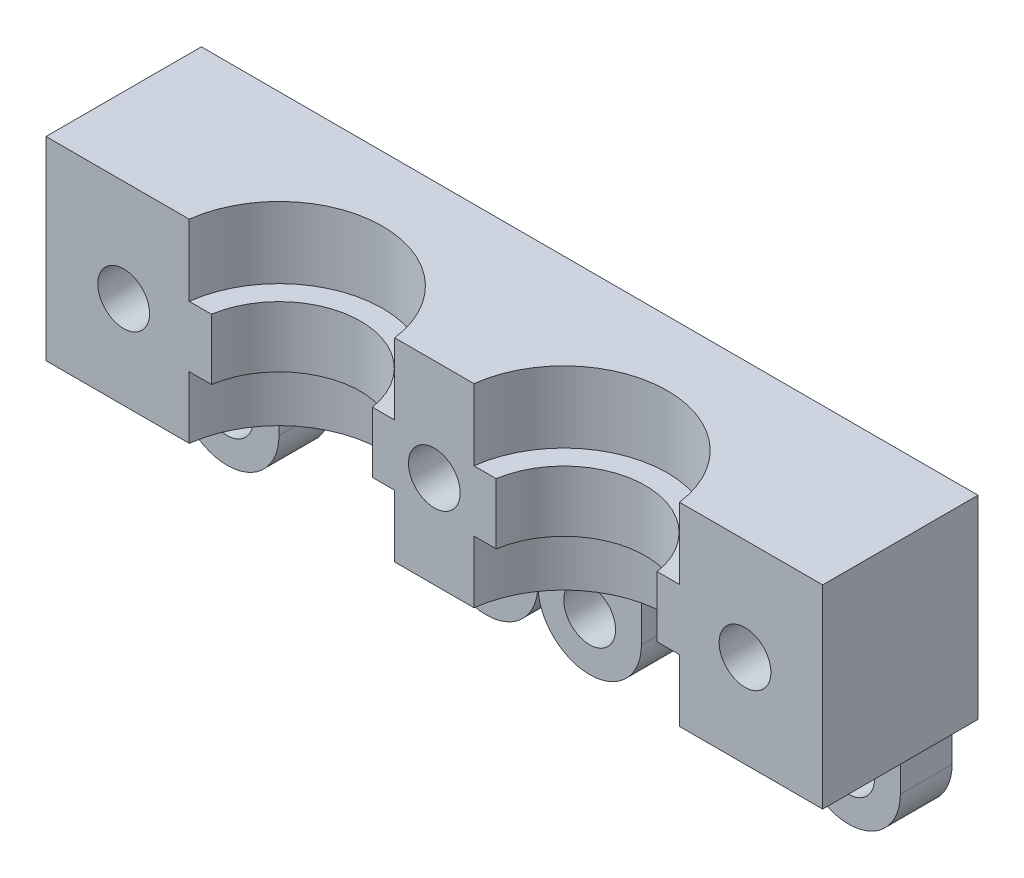
ISO-10303-21;
HEADER;
FILE_DESCRIPTION(('STEP AP214'),'2;1');
FILE_NAME('part.step','',(''),(''),'','','');
FILE_SCHEMA(('AUTOMOTIVE_DESIGN { 1 0 10303 214 1 1 1 1 }'));
ENDSEC;
DATA;
#1=APPLICATION_CONTEXT('core data for automotive mechanical design processes');
#2=APPLICATION_PROTOCOL_DEFINITION('international standard','automotive_design',2000,#1);
#3=PRODUCT_CONTEXT('',#1,'mechanical');
#4=PRODUCT('Part','Part','',(#3));
#5=PRODUCT_RELATED_PRODUCT_CATEGORY('part','',(#4));
#6=PRODUCT_DEFINITION_FORMATION('','',#4);
#7=PRODUCT_DEFINITION_CONTEXT('part definition',#1,'design');
#8=PRODUCT_DEFINITION('design','',#6,#7);
#9=PRODUCT_DEFINITION_SHAPE('','',#8);
#10=(LENGTH_UNIT() NAMED_UNIT(*) SI_UNIT(.MILLI.,.METRE.));
#11=(NAMED_UNIT(*) PLANE_ANGLE_UNIT() SI_UNIT($,.RADIAN.));
#12=(NAMED_UNIT(*) SI_UNIT($,.STERADIAN.) SOLID_ANGLE_UNIT());
#13=UNCERTAINTY_MEASURE_WITH_UNIT(LENGTH_MEASURE(1.E-05),#10,'distance_accuracy_value','');
#14=(GEOMETRIC_REPRESENTATION_CONTEXT(3) GLOBAL_UNCERTAINTY_ASSIGNED_CONTEXT((#13)) GLOBAL_UNIT_ASSIGNED_CONTEXT((#10,
#11,#12)) REPRESENTATION_CONTEXT('',''));
#15=CARTESIAN_POINT('',(0.,0.,0.));
#16=DIRECTION('',(0.,0.,1.));
#17=DIRECTION('',(1.,0.,0.));
#18=AXIS2_PLACEMENT_3D('',#15,#16,#17);
#19=CARTESIAN_POINT('',(-30.,-8.,15.));
#20=DIRECTION('',(0.,1.,0.));
#21=DIRECTION('',(-1.,0.,0.));
#22=AXIS2_PLACEMENT_3D('',#19,#20,#21);
#23=PLANE('',#22);
#24=DIRECTION('',(0.,0.,-1.));
#25=VECTOR('',#24,1.);
#26=CARTESIAN_POINT('',(30.,-8.,15.));
#27=LINE('',#26,#25);
#28=CARTESIAN_POINT('',(30.,-8.,12.));
#29=VERTEX_POINT('',#28);
#30=CARTESIAN_POINT('',(30.,-8.00000000000001,0.));
#31=VERTEX_POINT('',#30);
#32=EDGE_CURVE('E256',#29,#31,#27,.T.);
#33=ORIENTED_EDGE('',*,*,#32,.F.);
#34=DIRECTION('',(1.,0.,0.));
#35=VECTOR('',#34,1.);
#36=CARTESIAN_POINT('',(30.,-8.,12.));
#37=LINE('',#36,#35);
#38=CARTESIAN_POINT('',(18.9372539331938,-8.,12.));
#39=VERTEX_POINT('',#38);
#40=EDGE_CURVE('E234',#39,#29,#37,.T.);
#41=ORIENTED_EDGE('',*,*,#40,.F.);
#42=CARTESIAN_POINT('',(11.,-8.,13.));
#43=DIRECTION('',(0.,-1.,0.));
#44=DIRECTION('',(0.,0.,1.));
#45=AXIS2_PLACEMENT_3D('',#42,#43,#44);
#46=CIRCLE('',#45,8.);
#47=CARTESIAN_POINT('',(3.06274606680622,-8.,12.));
#48=VERTEX_POINT('',#47);
#49=EDGE_CURVE('E408',#48,#39,#46,.T.);
#50=ORIENTED_EDGE('',*,*,#49,.F.);
#51=CARTESIAN_POINT('',(-3.06274606680623,-8.,12.));
#52=VERTEX_POINT('',#51);
#53=EDGE_CURVE('E483',#52,#48,#37,.T.);
#54=ORIENTED_EDGE('',*,*,#53,.F.);
#55=CARTESIAN_POINT('',(-11.,-8.,13.));
#56=DIRECTION('',(0.,-1.,0.));
#57=DIRECTION('',(0.,0.,-1.));
#58=AXIS2_PLACEMENT_3D('',#55,#56,#57);
#59=CIRCLE('',#58,8.);
#60=CARTESIAN_POINT('',(-18.9372539331938,-8.,12.));
#61=VERTEX_POINT('',#60);
#62=EDGE_CURVE('E410',#61,#52,#59,.T.);
#63=ORIENTED_EDGE('',*,*,#62,.F.);
#64=CARTESIAN_POINT('',(-30.,-8.,12.));
#65=VERTEX_POINT('',#64);
#66=EDGE_CURVE('E485',#65,#61,#37,.T.);
#67=ORIENTED_EDGE('',*,*,#66,.F.);
#68=DIRECTION('',(0.,0.,-1.));
#69=VECTOR('',#68,1.);
#70=CARTESIAN_POINT('',(-30.,-8.,15.));
#71=LINE('',#70,#69);
#72=CARTESIAN_POINT('',(-30.,-8.00000000000001,0.));
#73=VERTEX_POINT('',#72);
#74=EDGE_CURVE('E257',#65,#73,#71,.T.);
#75=ORIENTED_EDGE('',*,*,#74,.T.);
#76=DIRECTION('',(1.,0.,0.));
#77=VECTOR('',#76,1.);
#78=CARTESIAN_POINT('',(-30.,-8.00000000000001,0.));
#79=LINE('',#78,#77);
#80=CARTESIAN_POINT('',(-28.,-8.,0.));
#81=VERTEX_POINT('',#80);
#82=EDGE_CURVE('E380',#73,#81,#79,.T.);
#83=ORIENTED_EDGE('',*,*,#82,.T.);
#84=DIRECTION('',(0.,0.,-1.));
#85=VECTOR('',#84,1.);
#86=CARTESIAN_POINT('',(-28.,-8.,15.));
#87=LINE('',#86,#85);
#88=CARTESIAN_POINT('',(-28.,-8.,4.));
#89=VERTEX_POINT('',#88);
#90=EDGE_CURVE('E277',#89,#81,#87,.T.);
#91=ORIENTED_EDGE('',*,*,#90,.F.);
#92=DIRECTION('',(1.,0.,0.));
#93=VECTOR('',#92,1.);
#94=CARTESIAN_POINT('',(-30.,-8.,4.));
#95=LINE('',#94,#93);
#96=CARTESIAN_POINT('',(28.,-8.,4.));
#97=VERTEX_POINT('',#96);
#98=EDGE_CURVE('E45',#89,#97,#95,.T.);
#99=ORIENTED_EDGE('',*,*,#98,.T.);
#100=DIRECTION('',(0.,0.,1.));
#101=VECTOR('',#100,1.);
#102=CARTESIAN_POINT('',(28.,-8.,15.));
#103=LINE('',#102,#101);
#104=CARTESIAN_POINT('',(28.,-8.,0.));
#105=VERTEX_POINT('',#104);
#106=EDGE_CURVE('E11',#105,#97,#103,.T.);
#107=ORIENTED_EDGE('',*,*,#106,.F.);
#108=EDGE_CURVE('E379',#105,#31,#79,.T.);
#109=ORIENTED_EDGE('',*,*,#108,.T.);
#110=EDGE_LOOP('',(#33,#41,#50,#54,#63,#67,#75,#83,#91,#99,#107,#109));
#111=FACE_BOUND('',#110,.T.);
#112=ADVANCED_FACE('F35',(#111),#23,.F.);
#113=CARTESIAN_POINT('',(-11.,7.,13.));
#114=DIRECTION('',(0.,-1.,0.));
#115=DIRECTION('',(0.,0.,-1.));
#116=AXIS2_PLACEMENT_3D('',#113,#114,#115);
#117=CYLINDRICAL_SURFACE('',#116,8.);
#118=ORIENTED_EDGE('',*,*,#62,.T.);
#119=DIRECTION('',(0.,-1.,0.));
#120=VECTOR('',#119,1.);
#121=CARTESIAN_POINT('',(-3.06274606680622,7.,12.));
#122=LINE('',#121,#120);
#123=CARTESIAN_POINT('',(-3.06274606680622,-3.2,12.));
#124=VERTEX_POINT('',#123);
#125=EDGE_CURVE('E527',#52,#124,#122,.F.);
#126=ORIENTED_EDGE('',*,*,#125,.T.);
#127=CARTESIAN_POINT('',(-11.,-3.2,13.));
#128=DIRECTION('',(0.,-1.,0.));
#129=DIRECTION('',(0.,0.,-1.));
#130=AXIS2_PLACEMENT_3D('',#127,#128,#129);
#131=CIRCLE('',#130,8.);
#132=CARTESIAN_POINT('',(-18.9372539331938,-3.2,12.));
#133=VERTEX_POINT('',#132);
#134=EDGE_CURVE('E405',#124,#133,#131,.F.);
#135=ORIENTED_EDGE('',*,*,#134,.T.);
#136=DIRECTION('',(0.,-1.,0.));
#137=VECTOR('',#136,1.);
#138=CARTESIAN_POINT('',(-18.9372539331938,7.,12.));
#139=LINE('',#138,#137);
#140=EDGE_CURVE('E518',#133,#61,#139,.T.);
#141=ORIENTED_EDGE('',*,*,#140,.T.);
#142=EDGE_LOOP('',(#118,#126,#135,#141));
#143=FACE_BOUND('',#142,.T.);
#144=ADVANCED_FACE('F570',(#143),#117,.F.);
#145=CARTESIAN_POINT('',(11.,7.,13.));
#146=DIRECTION('',(0.,-1.,0.));
#147=DIRECTION('',(0.,0.,-1.));
#148=AXIS2_PLACEMENT_3D('',#145,#146,#147);
#149=CYLINDRICAL_SURFACE('',#148,8.);
#150=ORIENTED_EDGE('',*,*,#49,.T.);
#151=DIRECTION('',(0.,-1.,0.));
#152=VECTOR('',#151,1.);
#153=CARTESIAN_POINT('',(18.9372539331938,7.,12.));
#154=LINE('',#153,#152);
#155=CARTESIAN_POINT('',(18.9372539331938,-3.2,12.));
#156=VERTEX_POINT('',#155);
#157=EDGE_CURVE('E490',#39,#156,#154,.F.);
#158=ORIENTED_EDGE('',*,*,#157,.T.);
#159=CARTESIAN_POINT('',(11.,-3.2,13.));
#160=DIRECTION('',(0.,-1.,0.));
#161=DIRECTION('',(0.,0.,-1.));
#162=AXIS2_PLACEMENT_3D('',#159,#160,#161);
#163=CIRCLE('',#162,8.);
#164=CARTESIAN_POINT('',(3.06274606680622,-3.2,12.));
#165=VERTEX_POINT('',#164);
#166=EDGE_CURVE('E270',#156,#165,#163,.F.);
#167=ORIENTED_EDGE('',*,*,#166,.T.);
#168=DIRECTION('',(0.,-1.,0.));
#169=VECTOR('',#168,1.);
#170=CARTESIAN_POINT('',(3.06274606680622,7.,12.));
#171=LINE('',#170,#169);
#172=EDGE_CURVE('E492',#165,#48,#171,.T.);
#173=ORIENTED_EDGE('',*,*,#172,.T.);
#174=EDGE_LOOP('',(#150,#158,#167,#173));
#175=FACE_BOUND('',#174,.T.);
#176=ADVANCED_FACE('F489',(#175),#149,.F.);
#177=CARTESIAN_POINT('',(30.,15.,5.));
#178=DIRECTION('',(-1.,0.,0.));
#179=DIRECTION('',(0.,-1.,0.));
#180=AXIS2_PLACEMENT_3D('',#177,#178,#179);
#181=PLANE('',#180);
#182=DIRECTION('',(0.,0.,-1.));
#183=VECTOR('',#182,1.);
#184=CARTESIAN_POINT('',(30.,7.,15.));
#185=LINE('',#184,#183);
#186=CARTESIAN_POINT('',(30.,7.,12.));
#187=VERTEX_POINT('',#186);
#188=CARTESIAN_POINT('',(30.,7.,0.));
#189=VERTEX_POINT('',#188);
#190=EDGE_CURVE('E245',#187,#189,#185,.T.);
#191=ORIENTED_EDGE('',*,*,#190,.F.);
#192=DIRECTION('',(0.,1.,0.));
#193=VECTOR('',#192,1.);
#194=CARTESIAN_POINT('',(30.,7.,12.));
#195=LINE('',#194,#193);
#196=EDGE_CURVE('E228',#29,#187,#195,.T.);
#197=ORIENTED_EDGE('',*,*,#196,.F.);
#198=ORIENTED_EDGE('',*,*,#32,.T.);
#199=DIRECTION('',(0.,1.,0.));
#200=VECTOR('',#199,1.);
#201=CARTESIAN_POINT('',(30.,15.,0.));
#202=LINE('',#201,#200);
#203=EDGE_CURVE('E254',#31,#189,#202,.T.);
#204=ORIENTED_EDGE('',*,*,#203,.T.);
#205=EDGE_LOOP('',(#191,#197,#198,#204));
#206=FACE_BOUND('',#205,.T.);
#207=ADVANCED_FACE('F37',(#206),#181,.F.);
#208=CARTESIAN_POINT('',(-30.,15.,5.));
#209=DIRECTION('',(1.,0.,0.));
#210=DIRECTION('',(0.,1.,0.));
#211=AXIS2_PLACEMENT_3D('',#208,#209,#210);
#212=PLANE('',#211);
#213=ORIENTED_EDGE('',*,*,#74,.F.);
#214=DIRECTION('',(0.,-1.,0.));
#215=VECTOR('',#214,1.);
#216=CARTESIAN_POINT('',(-30.,7.,12.));
#217=LINE('',#216,#215);
#218=CARTESIAN_POINT('',(-30.,7.,12.));
#219=VERTEX_POINT('',#218);
#220=EDGE_CURVE('E250',#219,#65,#217,.T.);
#221=ORIENTED_EDGE('',*,*,#220,.F.);
#222=DIRECTION('',(0.,0.,-1.));
#223=VECTOR('',#222,1.);
#224=CARTESIAN_POINT('',(-30.,7.,15.));
#225=LINE('',#224,#223);
#226=CARTESIAN_POINT('',(-30.,7.,0.));
#227=VERTEX_POINT('',#226);
#228=EDGE_CURVE('E39',#219,#227,#225,.T.);
#229=ORIENTED_EDGE('',*,*,#228,.T.);
#230=DIRECTION('',(0.,-1.,0.));
#231=VECTOR('',#230,1.);
#232=CARTESIAN_POINT('',(-30.,15.,0.));
#233=LINE('',#232,#231);
#234=EDGE_CURVE('E271',#227,#73,#233,.T.);
#235=ORIENTED_EDGE('',*,*,#234,.T.);
#236=EDGE_LOOP('',(#213,#221,#229,#235));
#237=FACE_BOUND('',#236,.T.);
#238=ADVANCED_FACE('F422',(#237),#212,.F.);
#239=CARTESIAN_POINT('',(0.,0.,0.));
#240=DIRECTION('',(0.,0.,1.));
#241=DIRECTION('',(1.,0.,0.));
#242=AXIS2_PLACEMENT_3D('',#239,#240,#241);
#243=PLANE('',#242);
#244=ORIENTED_EDGE('',*,*,#108,.F.);
#245=DIRECTION('',(0.,1.,0.));
#246=VECTOR('',#245,1.);
#247=CARTESIAN_POINT('',(28.,-12.0064356958142,0.));
#248=LINE('',#247,#246);
#249=CARTESIAN_POINT('',(28.,-12.0064356958142,0.));
#250=VERTEX_POINT('',#249);
#251=EDGE_CURVE('E293',#250,#105,#248,.T.);
#252=ORIENTED_EDGE('',*,*,#251,.F.);
#253=CARTESIAN_POINT('',(24.,-12.0064356958142,0.));
#254=DIRECTION('',(0.,0.,1.));
#255=DIRECTION('',(1.,0.,0.));
#256=AXIS2_PLACEMENT_3D('',#253,#254,#255);
#257=CIRCLE('',#256,4.);
#258=CARTESIAN_POINT('',(20.,-12.0064356958142,0.));
#259=VERTEX_POINT('',#258);
#260=EDGE_CURVE('E324',#259,#250,#257,.T.);
#261=ORIENTED_EDGE('',*,*,#260,.F.);
#262=DIRECTION('',(0.,-1.,0.));
#263=VECTOR('',#262,1.);
#264=CARTESIAN_POINT('',(20.,-12.0064356958142,0.));
#265=LINE('',#264,#263);
#266=CARTESIAN_POINT('',(20.,-8.00643569581419,0.));
#267=VERTEX_POINT('',#266);
#268=EDGE_CURVE('E302',#267,#259,#265,.T.);
#269=ORIENTED_EDGE('',*,*,#268,.F.);
#270=DIRECTION('',(1.,0.,0.));
#271=VECTOR('',#270,1.);
#272=CARTESIAN_POINT('',(8.,-8.00643569581419,0.));
#273=LINE('',#272,#271);
#274=CARTESIAN_POINT('',(8.,-8.00643569581419,0.));
#275=VERTEX_POINT('',#274);
#276=EDGE_CURVE('E345',#275,#267,#273,.T.);
#277=ORIENTED_EDGE('',*,*,#276,.F.);
#278=DIRECTION('',(0.,1.,0.));
#279=VECTOR('',#278,1.);
#280=CARTESIAN_POINT('',(8.,-12.0064356958142,0.));
#281=LINE('',#280,#279);
#282=CARTESIAN_POINT('',(8.,-12.0064356958142,0.));
#283=VERTEX_POINT('',#282);
#284=EDGE_CURVE('E343',#283,#275,#281,.T.);
#285=ORIENTED_EDGE('',*,*,#284,.F.);
#286=CARTESIAN_POINT('',(4.,-12.0064356958142,0.));
#287=DIRECTION('',(0.,0.,1.));
#288=DIRECTION('',(-1.,0.,0.));
#289=AXIS2_PLACEMENT_3D('',#286,#287,#288);
#290=CIRCLE('',#289,4.);
#291=CARTESIAN_POINT('',(0.,-12.0064356958142,0.));
#292=VERTEX_POINT('',#291);
#293=EDGE_CURVE('E341',#292,#283,#290,.T.);
#294=ORIENTED_EDGE('',*,*,#293,.F.);
#295=CARTESIAN_POINT('',(-4.,-12.0064356958142,0.));
#296=DIRECTION('',(0.,0.,1.));
#297=DIRECTION('',(-1.,0.,0.));
#298=AXIS2_PLACEMENT_3D('',#295,#296,#297);
#299=CIRCLE('',#298,4.);
#300=CARTESIAN_POINT('',(-8.,-12.0064356958142,0.));
#301=VERTEX_POINT('',#300);
#302=EDGE_CURVE('E339',#301,#292,#299,.T.);
#303=ORIENTED_EDGE('',*,*,#302,.F.);
#304=DIRECTION('',(0.,-1.,0.));
#305=VECTOR('',#304,1.);
#306=CARTESIAN_POINT('',(-8.,-12.0064356958142,0.));
#307=LINE('',#306,#305);
#308=CARTESIAN_POINT('',(-8.,-8.00643569581419,0.));
#309=VERTEX_POINT('',#308);
#310=EDGE_CURVE('E337',#309,#301,#307,.T.);
#311=ORIENTED_EDGE('',*,*,#310,.F.);
#312=DIRECTION('',(1.,0.,0.));
#313=VECTOR('',#312,1.);
#314=CARTESIAN_POINT('',(-20.,-8.00643569581419,0.));
#315=LINE('',#314,#313);
#316=CARTESIAN_POINT('',(-20.,-8.00643569581419,0.));
#317=VERTEX_POINT('',#316);
#318=EDGE_CURVE('E335',#317,#309,#315,.T.);
#319=ORIENTED_EDGE('',*,*,#318,.F.);
#320=DIRECTION('',(0.,1.,0.));
#321=VECTOR('',#320,1.);
#322=CARTESIAN_POINT('',(-20.,-12.0064356958142,0.));
#323=LINE('',#322,#321);
#324=CARTESIAN_POINT('',(-20.,-12.0064356958142,0.));
#325=VERTEX_POINT('',#324);
#326=EDGE_CURVE('E333',#325,#317,#323,.T.);
#327=ORIENTED_EDGE('',*,*,#326,.F.);
#328=CARTESIAN_POINT('',(-24.,-12.0064356958142,0.));
#329=DIRECTION('',(0.,0.,1.));
#330=DIRECTION('',(-1.,0.,0.));
#331=AXIS2_PLACEMENT_3D('',#328,#329,#330);
#332=CIRCLE('',#331,3.99999999999999);
#333=CARTESIAN_POINT('',(-28.,-12.0064356958142,0.));
#334=VERTEX_POINT('',#333);
#335=EDGE_CURVE('E331',#334,#325,#332,.T.);
#336=ORIENTED_EDGE('',*,*,#335,.F.);
#337=DIRECTION('',(0.,-1.,0.));
#338=VECTOR('',#337,1.);
#339=CARTESIAN_POINT('',(-28.,-12.0064356958142,0.));
#340=LINE('',#339,#338);
#341=EDGE_CURVE('E329',#81,#334,#340,.T.);
#342=ORIENTED_EDGE('',*,*,#341,.F.);
#343=ORIENTED_EDGE('',*,*,#82,.F.);
#344=ORIENTED_EDGE('',*,*,#234,.F.);
#345=DIRECTION('',(-1.,0.,0.));
#346=VECTOR('',#345,1.);
#347=CARTESIAN_POINT('',(30.,7.,0.));
#348=LINE('',#347,#346);
#349=EDGE_CURVE('E382',#189,#227,#348,.T.);
#350=ORIENTED_EDGE('',*,*,#349,.F.);
#351=ORIENTED_EDGE('',*,*,#203,.F.);
#352=EDGE_LOOP('',(#244,#252,#261,#269,#277,#285,#294,#303,#311,#319,#327,#336,#342,#343,#344,
#350,#351));
#353=FACE_BOUND('',#352,.T.);
#354=CARTESIAN_POINT('',(-4.,-12.0064356958142,0.));
#355=DIRECTION('',(0.,0.,1.));
#356=DIRECTION('',(-1.,0.,0.));
#357=AXIS2_PLACEMENT_3D('',#354,#355,#356);
#358=CIRCLE('',#357,2.);
#359=CARTESIAN_POINT('',(-6.,-12.0064356958142,0.));
#360=VERTEX_POINT('',#359);
#361=EDGE_CURVE('E530',#360,#360,#358,.T.);
#362=ORIENTED_EDGE('',*,*,#361,.T.);
#363=EDGE_LOOP('',(#362));
#364=FACE_BOUND('',#363,.T.);
#365=CARTESIAN_POINT('',(-24.,-12.0064356958142,0.));
#366=DIRECTION('',(0.,0.,1.));
#367=DIRECTION('',(-1.,0.,0.));
#368=AXIS2_PLACEMENT_3D('',#365,#366,#367);
#369=CIRCLE('',#368,2.);
#370=CARTESIAN_POINT('',(-26.,-12.0064356958142,0.));
#371=VERTEX_POINT('',#370);
#372=EDGE_CURVE('E540',#371,#371,#369,.T.);
#373=ORIENTED_EDGE('',*,*,#372,.T.);
#374=EDGE_LOOP('',(#373));
#375=FACE_BOUND('',#374,.T.);
#376=CARTESIAN_POINT('',(24.,-12.0064356958142,0.));
#377=DIRECTION('',(0.,0.,1.));
#378=DIRECTION('',(1.,0.,0.));
#379=AXIS2_PLACEMENT_3D('',#376,#377,#378);
#380=CIRCLE('',#379,2.);
#381=CARTESIAN_POINT('',(26.,-12.0064356958142,0.));
#382=VERTEX_POINT('',#381);
#383=EDGE_CURVE('E546',#382,#382,#380,.T.);
#384=ORIENTED_EDGE('',*,*,#383,.T.);
#385=EDGE_LOOP('',(#384));
#386=FACE_BOUND('',#385,.T.);
#387=CARTESIAN_POINT('',(4.,-12.0064356958142,0.));
#388=DIRECTION('',(0.,0.,1.));
#389=DIRECTION('',(1.,0.,0.));
#390=AXIS2_PLACEMENT_3D('',#387,#388,#389);
#391=CIRCLE('',#390,2.);
#392=CARTESIAN_POINT('',(6.,-12.0064356958142,0.));
#393=VERTEX_POINT('',#392);
#394=EDGE_CURVE('E534',#393,#393,#391,.T.);
#395=ORIENTED_EDGE('',*,*,#394,.T.);
#396=EDGE_LOOP('',(#395));
#397=FACE_BOUND('',#396,.T.);
#398=CARTESIAN_POINT('',(0.,-0.850000000000002,0.));
#399=DIRECTION('',(0.,0.,1.));
#400=DIRECTION('',(1.,0.,0.));
#401=AXIS2_PLACEMENT_3D('',#398,#399,#400);
#402=CIRCLE('',#401,2.);
#403=CARTESIAN_POINT('',(2.,-0.850000000000002,0.));
#404=VERTEX_POINT('',#403);
#405=EDGE_CURVE('E390',#404,#404,#402,.T.);
#406=ORIENTED_EDGE('',*,*,#405,.T.);
#407=EDGE_LOOP('',(#406));
#408=FACE_BOUND('',#407,.T.);
#409=CARTESIAN_POINT('',(24.,-0.850000000000002,0.));
#410=DIRECTION('',(0.,0.,1.));
#411=DIRECTION('',(1.,0.,0.));
#412=AXIS2_PLACEMENT_3D('',#409,#410,#411);
#413=CIRCLE('',#412,2.);
#414=CARTESIAN_POINT('',(26.,-0.850000000000002,0.));
#415=VERTEX_POINT('',#414);
#416=EDGE_CURVE('E387',#415,#415,#413,.T.);
#417=ORIENTED_EDGE('',*,*,#416,.T.);
#418=EDGE_LOOP('',(#417));
#419=FACE_BOUND('',#418,.T.);
#420=CARTESIAN_POINT('',(-24.,-0.850000000000002,0.));
#421=DIRECTION('',(0.,0.,1.));
#422=DIRECTION('',(1.,0.,0.));
#423=AXIS2_PLACEMENT_3D('',#420,#421,#422);
#424=CIRCLE('',#423,2.);
#425=CARTESIAN_POINT('',(-22.,-0.850000000000002,0.));
#426=VERTEX_POINT('',#425);
#427=EDGE_CURVE('E384',#426,#426,#424,.T.);
#428=ORIENTED_EDGE('',*,*,#427,.T.);
#429=EDGE_LOOP('',(#428));
#430=FACE_BOUND('',#429,.T.);
#431=ADVANCED_FACE('F426',(#353,#364,#375,#386,#397,#408,#419,#430),#243,.F.);
#432=CARTESIAN_POINT('',(-30.,7.,15.));
#433=DIRECTION('',(0.,-1.,0.));
#434=DIRECTION('',(0.,0.,-1.));
#435=AXIS2_PLACEMENT_3D('',#432,#433,#434);
#436=PLANE('',#435);
#437=ORIENTED_EDGE('',*,*,#228,.F.);
#438=DIRECTION('',(-1.,0.,0.));
#439=VECTOR('',#438,1.);
#440=CARTESIAN_POINT('',(30.,7.,12.));
#441=LINE('',#440,#439);
#442=CARTESIAN_POINT('',(-18.9372539331938,7.,12.));
#443=VERTEX_POINT('',#442);
#444=EDGE_CURVE('E238',#443,#219,#441,.T.);
#445=ORIENTED_EDGE('',*,*,#444,.F.);
#446=CARTESIAN_POINT('',(-11.,7.,13.));
#447=DIRECTION('',(0.,-1.,0.));
#448=DIRECTION('',(0.,0.,-1.));
#449=AXIS2_PLACEMENT_3D('',#446,#447,#448);
#450=CIRCLE('',#449,8.);
#451=CARTESIAN_POINT('',(-3.06274606680623,7.,12.));
#452=VERTEX_POINT('',#451);
#453=EDGE_CURVE('E259',#443,#452,#450,.T.);
#454=ORIENTED_EDGE('',*,*,#453,.T.);
#455=CARTESIAN_POINT('',(3.06274606680622,7.,12.));
#456=VERTEX_POINT('',#455);
#457=EDGE_CURVE('E251',#456,#452,#441,.T.);
#458=ORIENTED_EDGE('',*,*,#457,.F.);
#459=CARTESIAN_POINT('',(11.,7.,13.));
#460=DIRECTION('',(0.,-1.,0.));
#461=DIRECTION('',(0.,0.,1.));
#462=AXIS2_PLACEMENT_3D('',#459,#460,#461);
#463=CIRCLE('',#462,8.);
#464=CARTESIAN_POINT('',(18.9372539331938,7.,12.));
#465=VERTEX_POINT('',#464);
#466=EDGE_CURVE('E249',#456,#465,#463,.T.);
#467=ORIENTED_EDGE('',*,*,#466,.T.);
#468=EDGE_CURVE('E231',#187,#465,#441,.T.);
#469=ORIENTED_EDGE('',*,*,#468,.F.);
#470=ORIENTED_EDGE('',*,*,#190,.T.);
#471=ORIENTED_EDGE('',*,*,#349,.T.);
#472=EDGE_LOOP('',(#437,#445,#454,#458,#467,#469,#470,#471));
#473=FACE_BOUND('',#472,.T.);
#474=ADVANCED_FACE('F243',(#473),#436,.F.);
#475=CARTESIAN_POINT('',(-11.,1.5,13.));
#476=DIRECTION('',(0.,1.,0.));
#477=DIRECTION('',(0.,0.,1.));
#478=AXIS2_PLACEMENT_3D('',#475,#476,#477);
#479=CIRCLE('',#478,8.);
#480=CARTESIAN_POINT('',(-18.9372539331938,1.5,12.));
#481=VERTEX_POINT('',#480);
#482=CARTESIAN_POINT('',(-3.06274606680622,1.5,12.));
#483=VERTEX_POINT('',#482);
#484=EDGE_CURVE('E402',#481,#483,#479,.F.);
#485=ORIENTED_EDGE('',*,*,#484,.T.);
#486=DIRECTION('',(0.,-1.,0.));
#487=VECTOR('',#486,1.);
#488=CARTESIAN_POINT('',(-3.06274606680622,7.,12.));
#489=LINE('',#488,#487);
#490=EDGE_CURVE('E524',#483,#452,#489,.F.);
#491=ORIENTED_EDGE('',*,*,#490,.T.);
#492=ORIENTED_EDGE('',*,*,#453,.F.);
#493=DIRECTION('',(0.,-1.,0.));
#494=VECTOR('',#493,1.);
#495=CARTESIAN_POINT('',(-18.9372539331938,7.,12.));
#496=LINE('',#495,#494);
#497=EDGE_CURVE('E514',#443,#481,#496,.T.);
#498=ORIENTED_EDGE('',*,*,#497,.T.);
#499=EDGE_LOOP('',(#485,#491,#492,#498));
#500=FACE_BOUND('',#499,.T.);
#501=ADVANCED_FACE('F579',(#500),#117,.F.);
#502=CARTESIAN_POINT('',(11.,1.5,13.));
#503=DIRECTION('',(0.,1.,0.));
#504=DIRECTION('',(0.,0.,1.));
#505=AXIS2_PLACEMENT_3D('',#502,#503,#504);
#506=CIRCLE('',#505,8.);
#507=CARTESIAN_POINT('',(3.06274606680622,1.5,12.));
#508=VERTEX_POINT('',#507);
#509=CARTESIAN_POINT('',(18.9372539331938,1.5,12.));
#510=VERTEX_POINT('',#509);
#511=EDGE_CURVE('E267',#508,#510,#506,.F.);
#512=ORIENTED_EDGE('',*,*,#511,.T.);
#513=DIRECTION('',(0.,-1.,0.));
#514=VECTOR('',#513,1.);
#515=CARTESIAN_POINT('',(18.9372539331938,7.,12.));
#516=LINE('',#515,#514);
#517=EDGE_CURVE('E504',#510,#465,#516,.F.);
#518=ORIENTED_EDGE('',*,*,#517,.T.);
#519=ORIENTED_EDGE('',*,*,#466,.F.);
#520=DIRECTION('',(0.,-1.,0.));
#521=VECTOR('',#520,1.);
#522=CARTESIAN_POINT('',(3.06274606680622,7.,12.));
#523=LINE('',#522,#521);
#524=EDGE_CURVE('E494',#456,#508,#523,.T.);
#525=ORIENTED_EDGE('',*,*,#524,.T.);
#526=EDGE_LOOP('',(#512,#518,#519,#525));
#527=FACE_BOUND('',#526,.T.);
#528=ADVANCED_FACE('F591',(#527),#149,.F.);
#529=CARTESIAN_POINT('',(-30.,1.5,-55.1838018074631));
#530=DIRECTION('',(0.,1.,0.));
#531=DIRECTION('',(0.,0.,1.));
#532=AXIS2_PLACEMENT_3D('',#529,#530,#531);
#533=PLANE('',#532);
#534=DIRECTION('',(-1.,0.,0.));
#535=VECTOR('',#534,1.);
#536=CARTESIAN_POINT('',(-30.,1.5,12.));
#537=LINE('',#536,#535);
#538=CARTESIAN_POINT('',(17.2201286160336,1.5,12.));
#539=VERTEX_POINT('',#538);
#540=EDGE_CURVE('E506',#510,#539,#537,.T.);
#541=ORIENTED_EDGE('',*,*,#540,.F.);
#542=ORIENTED_EDGE('',*,*,#511,.F.);
#543=CARTESIAN_POINT('',(4.7798713839664,1.5,12.));
#544=VERTEX_POINT('',#543);
#545=EDGE_CURVE('E500',#544,#508,#537,.T.);
#546=ORIENTED_EDGE('',*,*,#545,.F.);
#547=CARTESIAN_POINT('',(11.,1.5,13.));
#548=DIRECTION('',(0.,1.,0.));
#549=DIRECTION('',(0.,0.,1.));
#550=AXIS2_PLACEMENT_3D('',#547,#548,#549);
#551=CIRCLE('',#550,6.3);
#552=EDGE_CURVE('E396',#539,#544,#551,.T.);
#553=ORIENTED_EDGE('',*,*,#552,.F.);
#554=EDGE_LOOP('',(#541,#542,#546,#553));
#555=FACE_BOUND('',#554,.T.);
#556=ADVANCED_FACE('F596',(#555),#533,.T.);
#557=CARTESIAN_POINT('',(-30.,-3.2,-55.1838018074631));
#558=DIRECTION('',(0.,-1.,0.));
#559=DIRECTION('',(0.,0.,-1.));
#560=AXIS2_PLACEMENT_3D('',#557,#558,#559);
#561=PLANE('',#560);
#562=DIRECTION('',(1.,0.,0.));
#563=VECTOR('',#562,1.);
#564=CARTESIAN_POINT('',(-30.,-3.2,12.));
#565=LINE('',#564,#563);
#566=CARTESIAN_POINT('',(4.7798713839664,-3.2,12.));
#567=VERTEX_POINT('',#566);
#568=EDGE_CURVE('E61',#165,#567,#565,.T.);
#569=ORIENTED_EDGE('',*,*,#568,.F.);
#570=ORIENTED_EDGE('',*,*,#166,.F.);
#571=CARTESIAN_POINT('',(17.2201286160336,-3.2,12.));
#572=VERTEX_POINT('',#571);
#573=EDGE_CURVE('E497',#572,#156,#565,.T.);
#574=ORIENTED_EDGE('',*,*,#573,.F.);
#575=CARTESIAN_POINT('',(11.,-3.2,13.));
#576=DIRECTION('',(0.,-1.,0.));
#577=DIRECTION('',(0.,0.,1.));
#578=AXIS2_PLACEMENT_3D('',#575,#576,#577);
#579=CIRCLE('',#578,6.3);
#580=EDGE_CURVE('E393',#567,#572,#579,.T.);
#581=ORIENTED_EDGE('',*,*,#580,.F.);
#582=EDGE_LOOP('',(#569,#570,#574,#581));
#583=FACE_BOUND('',#582,.T.);
#584=ADVANCED_FACE('F602',(#583),#561,.T.);
#585=DIRECTION('',(1.,0.,0.));
#586=VECTOR('',#585,1.);
#587=CARTESIAN_POINT('',(-30.,-3.2,12.));
#588=LINE('',#587,#586);
#589=CARTESIAN_POINT('',(-17.2201286160336,-3.2,12.));
#590=VERTEX_POINT('',#589);
#591=EDGE_CURVE('E53',#133,#590,#588,.T.);
#592=ORIENTED_EDGE('',*,*,#591,.F.);
#593=ORIENTED_EDGE('',*,*,#134,.F.);
#594=CARTESIAN_POINT('',(-4.7798713839664,-3.2,12.));
#595=VERTEX_POINT('',#594);
#596=EDGE_CURVE('E515',#595,#124,#588,.T.);
#597=ORIENTED_EDGE('',*,*,#596,.F.);
#598=CARTESIAN_POINT('',(-11.,-3.2,13.));
#599=DIRECTION('',(0.,-1.,0.));
#600=DIRECTION('',(0.,0.,-1.));
#601=AXIS2_PLACEMENT_3D('',#598,#599,#600);
#602=CIRCLE('',#601,6.3);
#603=EDGE_CURVE('E399',#590,#595,#602,.T.);
#604=ORIENTED_EDGE('',*,*,#603,.F.);
#605=EDGE_LOOP('',(#592,#593,#597,#604));
#606=FACE_BOUND('',#605,.T.);
#607=ADVANCED_FACE('F627',(#606),#561,.T.);
#608=DIRECTION('',(-1.,0.,0.));
#609=VECTOR('',#608,1.);
#610=CARTESIAN_POINT('',(-30.,1.5,12.));
#611=LINE('',#610,#609);
#612=CARTESIAN_POINT('',(-4.7798713839664,1.5,12.));
#613=VERTEX_POINT('',#612);
#614=EDGE_CURVE('E512',#483,#613,#611,.T.);
#615=ORIENTED_EDGE('',*,*,#614,.F.);
#616=ORIENTED_EDGE('',*,*,#484,.F.);
#617=CARTESIAN_POINT('',(-17.2201286160336,1.5,12.));
#618=VERTEX_POINT('',#617);
#619=EDGE_CURVE('E510',#618,#481,#611,.T.);
#620=ORIENTED_EDGE('',*,*,#619,.F.);
#621=CARTESIAN_POINT('',(-11.,1.5,13.));
#622=DIRECTION('',(0.,1.,0.));
#623=DIRECTION('',(0.,0.,1.));
#624=AXIS2_PLACEMENT_3D('',#621,#622,#623);
#625=CIRCLE('',#624,6.3);
#626=EDGE_CURVE('E274',#613,#618,#625,.T.);
#627=ORIENTED_EDGE('',*,*,#626,.F.);
#628=EDGE_LOOP('',(#615,#616,#620,#627));
#629=FACE_BOUND('',#628,.T.);
#630=ADVANCED_FACE('F605',(#629),#533,.T.);
#631=CARTESIAN_POINT('',(-11.,1.8,13.));
#632=DIRECTION('',(0.,-1.,0.));
#633=DIRECTION('',(0.,0.,-1.));
#634=AXIS2_PLACEMENT_3D('',#631,#632,#633);
#635=CYLINDRICAL_SURFACE('',#634,6.3);
#636=ORIENTED_EDGE('',*,*,#603,.T.);
#637=DIRECTION('',(0.,-1.,0.));
#638=VECTOR('',#637,1.);
#639=CARTESIAN_POINT('',(-4.7798713839664,1.8,12.));
#640=LINE('',#639,#638);
#641=EDGE_CURVE('E521',#595,#613,#640,.F.);
#642=ORIENTED_EDGE('',*,*,#641,.T.);
#643=ORIENTED_EDGE('',*,*,#626,.T.);
#644=DIRECTION('',(0.,-1.,0.));
#645=VECTOR('',#644,1.);
#646=CARTESIAN_POINT('',(-17.2201286160336,1.8,12.));
#647=LINE('',#646,#645);
#648=EDGE_CURVE('E508',#618,#590,#647,.T.);
#649=ORIENTED_EDGE('',*,*,#648,.T.);
#650=EDGE_LOOP('',(#636,#642,#643,#649));
#651=FACE_BOUND('',#650,.T.);
#652=ADVANCED_FACE('F630',(#651),#635,.F.);
#653=CARTESIAN_POINT('',(11.,1.8,13.));
#654=DIRECTION('',(0.,-1.,0.));
#655=DIRECTION('',(0.,0.,-1.));
#656=AXIS2_PLACEMENT_3D('',#653,#654,#655);
#657=CYLINDRICAL_SURFACE('',#656,6.3);
#658=ORIENTED_EDGE('',*,*,#580,.T.);
#659=DIRECTION('',(0.,-1.,0.));
#660=VECTOR('',#659,1.);
#661=CARTESIAN_POINT('',(17.2201286160336,1.8,12.));
#662=LINE('',#661,#660);
#663=EDGE_CURVE('E493',#572,#539,#662,.F.);
#664=ORIENTED_EDGE('',*,*,#663,.T.);
#665=ORIENTED_EDGE('',*,*,#552,.T.);
#666=DIRECTION('',(0.,-1.,0.));
#667=VECTOR('',#666,1.);
#668=CARTESIAN_POINT('',(4.7798713839664,1.8,12.));
#669=LINE('',#668,#667);
#670=EDGE_CURVE('E612',#544,#567,#669,.T.);
#671=ORIENTED_EDGE('',*,*,#670,.T.);
#672=EDGE_LOOP('',(#658,#664,#665,#671));
#673=FACE_BOUND('',#672,.T.);
#674=ADVANCED_FACE('F676',(#673),#657,.F.);
#675=CARTESIAN_POINT('',(0.,-0.850000000000002,0.));
#676=DIRECTION('',(0.,0.,1.));
#677=DIRECTION('',(1.,0.,0.));
#678=AXIS2_PLACEMENT_3D('',#675,#676,#677);
#679=CYLINDRICAL_SURFACE('',#678,2.);
#680=CARTESIAN_POINT('',(0.,-0.850000000000002,12.));
#681=DIRECTION('',(0.,0.,-1.));
#682=DIRECTION('',(-1.,0.,0.));
#683=AXIS2_PLACEMENT_3D('',#680,#681,#682);
#684=CIRCLE('',#683,2.);
#685=CARTESIAN_POINT('',(-2.,-0.850000000000002,12.));
#686=VERTEX_POINT('',#685);
#687=EDGE_CURVE('E613',#686,#686,#684,.F.);
#688=ORIENTED_EDGE('',*,*,#687,.T.);
#689=EDGE_LOOP('',(#688));
#690=FACE_BOUND('',#689,.T.);
#691=ORIENTED_EDGE('',*,*,#405,.F.);
#692=EDGE_LOOP('',(#691));
#693=FACE_BOUND('',#692,.T.);
#694=ADVANCED_FACE('F668',(#690,#693),#679,.F.);
#695=CARTESIAN_POINT('',(24.,-0.850000000000002,0.));
#696=DIRECTION('',(0.,0.,1.));
#697=DIRECTION('',(1.,0.,0.));
#698=AXIS2_PLACEMENT_3D('',#695,#696,#697);
#699=CYLINDRICAL_SURFACE('',#698,2.);
#700=CARTESIAN_POINT('',(24.,-0.850000000000002,12.));
#701=DIRECTION('',(0.,0.,-1.));
#702=DIRECTION('',(-1.,0.,0.));
#703=AXIS2_PLACEMENT_3D('',#700,#701,#702);
#704=CIRCLE('',#703,2.);
#705=CARTESIAN_POINT('',(22.,-0.850000000000002,12.));
#706=VERTEX_POINT('',#705);
#707=EDGE_CURVE('E618',#706,#706,#704,.F.);
#708=ORIENTED_EDGE('',*,*,#707,.T.);
#709=EDGE_LOOP('',(#708));
#710=FACE_BOUND('',#709,.T.);
#711=ORIENTED_EDGE('',*,*,#416,.F.);
#712=EDGE_LOOP('',(#711));
#713=FACE_BOUND('',#712,.T.);
#714=ADVANCED_FACE('F660',(#710,#713),#699,.F.);
#715=CARTESIAN_POINT('',(-24.,-0.850000000000002,0.));
#716=DIRECTION('',(0.,0.,1.));
#717=DIRECTION('',(1.,0.,0.));
#718=AXIS2_PLACEMENT_3D('',#715,#716,#717);
#719=CYLINDRICAL_SURFACE('',#718,2.);
#720=CARTESIAN_POINT('',(-24.,-0.850000000000002,12.));
#721=DIRECTION('',(0.,0.,-1.));
#722=DIRECTION('',(-1.,0.,0.));
#723=AXIS2_PLACEMENT_3D('',#720,#721,#722);
#724=CIRCLE('',#723,2.);
#725=CARTESIAN_POINT('',(-26.,-0.850000000000002,12.));
#726=VERTEX_POINT('',#725);
#727=EDGE_CURVE('E262',#726,#726,#724,.F.);
#728=ORIENTED_EDGE('',*,*,#727,.T.);
#729=EDGE_LOOP('',(#728));
#730=FACE_BOUND('',#729,.T.);
#731=ORIENTED_EDGE('',*,*,#427,.F.);
#732=EDGE_LOOP('',(#731));
#733=FACE_BOUND('',#732,.T.);
#734=ADVANCED_FACE('F657',(#730,#733),#719,.F.);
#735=CARTESIAN_POINT('',(24.,-12.0064356958142,4.));
#736=DIRECTION('',(0.,0.,1.));
#737=DIRECTION('',(1.,0.,0.));
#738=AXIS2_PLACEMENT_3D('',#735,#736,#737);
#739=PLANE('',#738);
#740=CARTESIAN_POINT('',(-4.,-12.0064356958142,4.));
#741=DIRECTION('',(0.,0.,1.));
#742=DIRECTION('',(-1.,0.,0.));
#743=AXIS2_PLACEMENT_3D('',#740,#741,#742);
#744=CIRCLE('',#743,2.);
#745=CARTESIAN_POINT('',(-6.,-12.0064356958142,4.));
#746=VERTEX_POINT('',#745);
#747=EDGE_CURVE('E531',#746,#746,#744,.T.);
#748=ORIENTED_EDGE('',*,*,#747,.F.);
#749=EDGE_LOOP('',(#748));
#750=FACE_BOUND('',#749,.T.);
#751=CARTESIAN_POINT('',(-24.,-12.0064356958142,4.));
#752=DIRECTION('',(0.,0.,1.));
#753=DIRECTION('',(-1.,0.,0.));
#754=AXIS2_PLACEMENT_3D('',#751,#752,#753);
#755=CIRCLE('',#754,2.);
#756=CARTESIAN_POINT('',(-26.,-12.0064356958142,4.));
#757=VERTEX_POINT('',#756);
#758=EDGE_CURVE('E543',#757,#757,#755,.T.);
#759=ORIENTED_EDGE('',*,*,#758,.F.);
#760=EDGE_LOOP('',(#759));
#761=FACE_BOUND('',#760,.T.);
#762=CARTESIAN_POINT('',(24.,-12.0064356958142,4.));
#763=DIRECTION('',(0.,0.,1.));
#764=DIRECTION('',(1.,0.,0.));
#765=AXIS2_PLACEMENT_3D('',#762,#763,#764);
#766=CIRCLE('',#765,2.);
#767=CARTESIAN_POINT('',(26.,-12.0064356958142,4.));
#768=VERTEX_POINT('',#767);
#769=EDGE_CURVE('E327',#768,#768,#766,.T.);
#770=ORIENTED_EDGE('',*,*,#769,.F.);
#771=EDGE_LOOP('',(#770));
#772=FACE_BOUND('',#771,.T.);
#773=CARTESIAN_POINT('',(4.,-12.0064356958142,4.));
#774=DIRECTION('',(0.,0.,1.));
#775=DIRECTION('',(1.,0.,0.));
#776=AXIS2_PLACEMENT_3D('',#773,#774,#775);
#777=CIRCLE('',#776,2.);
#778=CARTESIAN_POINT('',(6.,-12.0064356958142,4.));
#779=VERTEX_POINT('',#778);
#780=EDGE_CURVE('E537',#779,#779,#777,.T.);
#781=ORIENTED_EDGE('',*,*,#780,.F.);
#782=EDGE_LOOP('',(#781));
#783=FACE_BOUND('',#782,.T.);
#784=ORIENTED_EDGE('',*,*,#98,.F.);
#785=DIRECTION('',(0.,-1.,0.));
#786=VECTOR('',#785,1.);
#787=CARTESIAN_POINT('',(-28.,-12.0064356958142,4.));
#788=LINE('',#787,#786);
#789=CARTESIAN_POINT('',(-28.,-12.0064356958142,4.));
#790=VERTEX_POINT('',#789);
#791=EDGE_CURVE('E298',#89,#790,#788,.T.);
#792=ORIENTED_EDGE('',*,*,#791,.T.);
#793=CARTESIAN_POINT('',(-24.,-12.0064356958142,4.));
#794=DIRECTION('',(0.,0.,1.));
#795=DIRECTION('',(-1.,0.,0.));
#796=AXIS2_PLACEMENT_3D('',#793,#794,#795);
#797=CIRCLE('',#796,3.99999999999999);
#798=CARTESIAN_POINT('',(-20.,-12.0064356958142,4.));
#799=VERTEX_POINT('',#798);
#800=EDGE_CURVE('E300',#790,#799,#797,.T.);
#801=ORIENTED_EDGE('',*,*,#800,.T.);
#802=DIRECTION('',(0.,1.,0.));
#803=VECTOR('',#802,1.);
#804=CARTESIAN_POINT('',(-20.,-12.0064356958142,4.));
#805=LINE('',#804,#803);
#806=CARTESIAN_POINT('',(-20.,-8.00643569581419,4.));
#807=VERTEX_POINT('',#806);
#808=EDGE_CURVE('E307',#799,#807,#805,.T.);
#809=ORIENTED_EDGE('',*,*,#808,.T.);
#810=DIRECTION('',(1.,0.,0.));
#811=VECTOR('',#810,1.);
#812=CARTESIAN_POINT('',(-20.,-8.00643569581419,4.));
#813=LINE('',#812,#811);
#814=CARTESIAN_POINT('',(-8.,-8.00643569581419,4.));
#815=VERTEX_POINT('',#814);
#816=EDGE_CURVE('E309',#807,#815,#813,.T.);
#817=ORIENTED_EDGE('',*,*,#816,.T.);
#818=DIRECTION('',(0.,-1.,0.));
#819=VECTOR('',#818,1.);
#820=CARTESIAN_POINT('',(-8.,-12.0064356958142,4.));
#821=LINE('',#820,#819);
#822=CARTESIAN_POINT('',(-8.,-12.0064356958142,4.));
#823=VERTEX_POINT('',#822);
#824=EDGE_CURVE('E311',#815,#823,#821,.T.);
#825=ORIENTED_EDGE('',*,*,#824,.T.);
#826=CARTESIAN_POINT('',(-4.,-12.0064356958142,4.));
#827=DIRECTION('',(0.,0.,1.));
#828=DIRECTION('',(-1.,0.,0.));
#829=AXIS2_PLACEMENT_3D('',#826,#827,#828);
#830=CIRCLE('',#829,4.);
#831=CARTESIAN_POINT('',(0.,-12.0064356958142,4.));
#832=VERTEX_POINT('',#831);
#833=EDGE_CURVE('E313',#823,#832,#830,.T.);
#834=ORIENTED_EDGE('',*,*,#833,.T.);
#835=CARTESIAN_POINT('',(4.,-12.0064356958142,4.));
#836=DIRECTION('',(0.,0.,1.));
#837=DIRECTION('',(-1.,0.,0.));
#838=AXIS2_PLACEMENT_3D('',#835,#836,#837);
#839=CIRCLE('',#838,4.);
#840=CARTESIAN_POINT('',(8.,-12.0064356958142,4.));
#841=VERTEX_POINT('',#840);
#842=EDGE_CURVE('E315',#832,#841,#839,.T.);
#843=ORIENTED_EDGE('',*,*,#842,.T.);
#844=DIRECTION('',(0.,1.,0.));
#845=VECTOR('',#844,1.);
#846=CARTESIAN_POINT('',(8.,-12.0064356958142,4.));
#847=LINE('',#846,#845);
#848=CARTESIAN_POINT('',(8.,-8.00643569581419,4.));
#849=VERTEX_POINT('',#848);
#850=EDGE_CURVE('E317',#841,#849,#847,.T.);
#851=ORIENTED_EDGE('',*,*,#850,.T.);
#852=DIRECTION('',(1.,0.,0.));
#853=VECTOR('',#852,1.);
#854=CARTESIAN_POINT('',(8.,-8.00643569581419,4.));
#855=LINE('',#854,#853);
#856=CARTESIAN_POINT('',(20.,-8.00643569581419,4.));
#857=VERTEX_POINT('',#856);
#858=EDGE_CURVE('E319',#849,#857,#855,.T.);
#859=ORIENTED_EDGE('',*,*,#858,.T.);
#860=DIRECTION('',(0.,-1.,0.));
#861=VECTOR('',#860,1.);
#862=CARTESIAN_POINT('',(20.,-12.0064356958142,4.));
#863=LINE('',#862,#861);
#864=CARTESIAN_POINT('',(20.,-12.0064356958142,4.));
#865=VERTEX_POINT('',#864);
#866=EDGE_CURVE('E321',#857,#865,#863,.T.);
#867=ORIENTED_EDGE('',*,*,#866,.T.);
#868=CARTESIAN_POINT('',(24.,-12.0064356958142,4.));
#869=DIRECTION('',(0.,0.,1.));
#870=DIRECTION('',(1.,0.,0.));
#871=AXIS2_PLACEMENT_3D('',#868,#869,#870);
#872=CIRCLE('',#871,4.);
#873=CARTESIAN_POINT('',(28.,-12.0064356958142,4.));
#874=VERTEX_POINT('',#873);
#875=EDGE_CURVE('E296',#865,#874,#872,.T.);
#876=ORIENTED_EDGE('',*,*,#875,.T.);
#877=DIRECTION('',(0.,1.,0.));
#878=VECTOR('',#877,1.);
#879=CARTESIAN_POINT('',(28.,-12.0064356958142,4.));
#880=LINE('',#879,#878);
#881=EDGE_CURVE('E291',#874,#97,#880,.T.);
#882=ORIENTED_EDGE('',*,*,#881,.T.);
#883=EDGE_LOOP('',(#784,#792,#801,#809,#817,#825,#834,#843,#851,#859,#867,#876,#882));
#884=FACE_BOUND('',#883,.T.);
#885=ADVANCED_FACE('F294',(#750,#761,#772,#783,#884),#739,.T.);
#886=CARTESIAN_POINT('',(28.,-12.0064356958142,4.));
#887=DIRECTION('',(-1.,0.,0.));
#888=DIRECTION('',(0.,0.,1.));
#889=AXIS2_PLACEMENT_3D('',#886,#887,#888);
#890=PLANE('',#889);
#891=ORIENTED_EDGE('',*,*,#251,.T.);
#892=ORIENTED_EDGE('',*,*,#106,.T.);
#893=ORIENTED_EDGE('',*,*,#881,.F.);
#894=DIRECTION('',(0.,0.,-1.));
#895=VECTOR('',#894,1.);
#896=CARTESIAN_POINT('',(28.,-12.0064356958142,4.));
#897=LINE('',#896,#895);
#898=EDGE_CURVE('E377',#874,#250,#897,.T.);
#899=ORIENTED_EDGE('',*,*,#898,.T.);
#900=EDGE_LOOP('',(#891,#892,#893,#899));
#901=FACE_BOUND('',#900,.T.);
#902=ADVANCED_FACE('F289',(#901),#890,.F.);
#903=CARTESIAN_POINT('',(-28.,-12.0064356958142,4.));
#904=DIRECTION('',(1.,0.,0.));
#905=DIRECTION('',(0.,0.,-1.));
#906=AXIS2_PLACEMENT_3D('',#903,#904,#905);
#907=PLANE('',#906);
#908=ORIENTED_EDGE('',*,*,#791,.F.);
#909=ORIENTED_EDGE('',*,*,#90,.T.);
#910=ORIENTED_EDGE('',*,*,#341,.T.);
#911=DIRECTION('',(0.,0.,-1.));
#912=VECTOR('',#911,1.);
#913=CARTESIAN_POINT('',(-28.,-12.0064356958142,4.));
#914=LINE('',#913,#912);
#915=EDGE_CURVE('E374',#790,#334,#914,.T.);
#916=ORIENTED_EDGE('',*,*,#915,.F.);
#917=EDGE_LOOP('',(#908,#909,#910,#916));
#918=FACE_BOUND('',#917,.T.);
#919=ADVANCED_FACE('F432',(#918),#907,.F.);
#920=CARTESIAN_POINT('',(24.,-12.0064356958142,4.));
#921=DIRECTION('',(0.,0.,-1.));
#922=DIRECTION('',(-1.,0.,0.));
#923=AXIS2_PLACEMENT_3D('',#920,#921,#922);
#924=CYLINDRICAL_SURFACE('',#923,4.);
#925=ORIENTED_EDGE('',*,*,#260,.T.);
#926=ORIENTED_EDGE('',*,*,#898,.F.);
#927=ORIENTED_EDGE('',*,*,#875,.F.);
#928=DIRECTION('',(0.,0.,-1.));
#929=VECTOR('',#928,1.);
#930=CARTESIAN_POINT('',(20.,-12.0064356958142,4.));
#931=LINE('',#930,#929);
#932=EDGE_CURVE('E323',#865,#259,#931,.T.);
#933=ORIENTED_EDGE('',*,*,#932,.T.);
#934=EDGE_LOOP('',(#925,#926,#927,#933));
#935=FACE_BOUND('',#934,.T.);
#936=ADVANCED_FACE('F480',(#935),#924,.T.);
#937=CARTESIAN_POINT('',(-24.,-12.0064356958142,4.));
#938=DIRECTION('',(0.,0.,-1.));
#939=DIRECTION('',(-1.,0.,0.));
#940=AXIS2_PLACEMENT_3D('',#937,#938,#939);
#941=CYLINDRICAL_SURFACE('',#940,3.99999999999999);
#942=ORIENTED_EDGE('',*,*,#335,.T.);
#943=DIRECTION('',(0.,0.,-1.));
#944=VECTOR('',#943,1.);
#945=CARTESIAN_POINT('',(-20.,-12.0064356958142,4.));
#946=LINE('',#945,#944);
#947=EDGE_CURVE('E371',#799,#325,#946,.T.);
#948=ORIENTED_EDGE('',*,*,#947,.F.);
#949=ORIENTED_EDGE('',*,*,#800,.F.);
#950=ORIENTED_EDGE('',*,*,#915,.T.);
#951=EDGE_LOOP('',(#942,#948,#949,#950));
#952=FACE_BOUND('',#951,.T.);
#953=ADVANCED_FACE('F439',(#952),#941,.T.);
#954=CARTESIAN_POINT('',(-20.,-12.0064356958142,4.));
#955=DIRECTION('',(-1.,0.,0.));
#956=DIRECTION('',(0.,0.,1.));
#957=AXIS2_PLACEMENT_3D('',#954,#955,#956);
#958=PLANE('',#957);
#959=ORIENTED_EDGE('',*,*,#326,.T.);
#960=DIRECTION('',(0.,0.,-1.));
#961=VECTOR('',#960,1.);
#962=CARTESIAN_POINT('',(-20.,-8.00643569581419,4.));
#963=LINE('',#962,#961);
#964=EDGE_CURVE('E368',#807,#317,#963,.T.);
#965=ORIENTED_EDGE('',*,*,#964,.F.);
#966=ORIENTED_EDGE('',*,*,#808,.F.);
#967=ORIENTED_EDGE('',*,*,#947,.T.);
#968=EDGE_LOOP('',(#959,#965,#966,#967));
#969=FACE_BOUND('',#968,.T.);
#970=ADVANCED_FACE('F442',(#969),#958,.F.);
#971=CARTESIAN_POINT('',(-20.,-8.00643569581419,4.));
#972=DIRECTION('',(0.,1.,0.));
#973=DIRECTION('',(0.,0.,1.));
#974=AXIS2_PLACEMENT_3D('',#971,#972,#973);
#975=PLANE('',#974);
#976=ORIENTED_EDGE('',*,*,#318,.T.);
#977=DIRECTION('',(0.,0.,-1.));
#978=VECTOR('',#977,1.);
#979=CARTESIAN_POINT('',(-8.,-8.00643569581419,4.));
#980=LINE('',#979,#978);
#981=EDGE_CURVE('E365',#815,#309,#980,.T.);
#982=ORIENTED_EDGE('',*,*,#981,.F.);
#983=ORIENTED_EDGE('',*,*,#816,.F.);
#984=ORIENTED_EDGE('',*,*,#964,.T.);
#985=EDGE_LOOP('',(#976,#982,#983,#984));
#986=FACE_BOUND('',#985,.T.);
#987=ADVANCED_FACE('F447',(#986),#975,.F.);
#988=CARTESIAN_POINT('',(-8.,-12.0064356958142,4.));
#989=DIRECTION('',(1.,0.,0.));
#990=DIRECTION('',(0.,0.,-1.));
#991=AXIS2_PLACEMENT_3D('',#988,#989,#990);
#992=PLANE('',#991);
#993=ORIENTED_EDGE('',*,*,#310,.T.);
#994=DIRECTION('',(0.,0.,-1.));
#995=VECTOR('',#994,1.);
#996=CARTESIAN_POINT('',(-8.,-12.0064356958142,4.));
#997=LINE('',#996,#995);
#998=EDGE_CURVE('E362',#823,#301,#997,.T.);
#999=ORIENTED_EDGE('',*,*,#998,.F.);
#1000=ORIENTED_EDGE('',*,*,#824,.F.);
#1001=ORIENTED_EDGE('',*,*,#981,.T.);
#1002=EDGE_LOOP('',(#993,#999,#1000,#1001));
#1003=FACE_BOUND('',#1002,.T.);
#1004=ADVANCED_FACE('F453',(#1003),#992,.F.);
#1005=CARTESIAN_POINT('',(-4.,-12.0064356958142,4.));
#1006=DIRECTION('',(0.,0.,-1.));
#1007=DIRECTION('',(-1.,0.,0.));
#1008=AXIS2_PLACEMENT_3D('',#1005,#1006,#1007);
#1009=CYLINDRICAL_SURFACE('',#1008,4.);
#1010=ORIENTED_EDGE('',*,*,#302,.T.);
#1011=DIRECTION('',(0.,0.,-1.));
#1012=VECTOR('',#1011,1.);
#1013=CARTESIAN_POINT('',(0.,-12.0064356958142,4.));
#1014=LINE('',#1013,#1012);
#1015=EDGE_CURVE('E359',#832,#292,#1014,.T.);
#1016=ORIENTED_EDGE('',*,*,#1015,.F.);
#1017=ORIENTED_EDGE('',*,*,#833,.F.);
#1018=ORIENTED_EDGE('',*,*,#998,.T.);
#1019=EDGE_LOOP('',(#1010,#1016,#1017,#1018));
#1020=FACE_BOUND('',#1019,.T.);
#1021=ADVANCED_FACE('F457',(#1020),#1009,.T.);
#1022=CARTESIAN_POINT('',(4.,-12.0064356958142,4.));
#1023=DIRECTION('',(0.,0.,-1.));
#1024=DIRECTION('',(-1.,0.,0.));
#1025=AXIS2_PLACEMENT_3D('',#1022,#1023,#1024);
#1026=CYLINDRICAL_SURFACE('',#1025,4.);
#1027=ORIENTED_EDGE('',*,*,#293,.T.);
#1028=DIRECTION('',(0.,0.,-1.));
#1029=VECTOR('',#1028,1.);
#1030=CARTESIAN_POINT('',(8.,-12.0064356958142,4.));
#1031=LINE('',#1030,#1029);
#1032=EDGE_CURVE('E356',#841,#283,#1031,.T.);
#1033=ORIENTED_EDGE('',*,*,#1032,.F.);
#1034=ORIENTED_EDGE('',*,*,#842,.F.);
#1035=ORIENTED_EDGE('',*,*,#1015,.T.);
#1036=EDGE_LOOP('',(#1027,#1033,#1034,#1035));
#1037=FACE_BOUND('',#1036,.T.);
#1038=ADVANCED_FACE('F462',(#1037),#1026,.T.);
#1039=CARTESIAN_POINT('',(8.,-12.0064356958142,4.));
#1040=DIRECTION('',(-1.,0.,0.));
#1041=DIRECTION('',(0.,0.,1.));
#1042=AXIS2_PLACEMENT_3D('',#1039,#1040,#1041);
#1043=PLANE('',#1042);
#1044=ORIENTED_EDGE('',*,*,#284,.T.);
#1045=DIRECTION('',(0.,0.,-1.));
#1046=VECTOR('',#1045,1.);
#1047=CARTESIAN_POINT('',(8.,-8.00643569581419,4.));
#1048=LINE('',#1047,#1046);
#1049=EDGE_CURVE('E353',#849,#275,#1048,.T.);
#1050=ORIENTED_EDGE('',*,*,#1049,.F.);
#1051=ORIENTED_EDGE('',*,*,#850,.F.);
#1052=ORIENTED_EDGE('',*,*,#1032,.T.);
#1053=EDGE_LOOP('',(#1044,#1050,#1051,#1052));
#1054=FACE_BOUND('',#1053,.T.);
#1055=ADVANCED_FACE('F468',(#1054),#1043,.F.);
#1056=CARTESIAN_POINT('',(8.,-8.00643569581419,4.));
#1057=DIRECTION('',(0.,1.,0.));
#1058=DIRECTION('',(0.,0.,1.));
#1059=AXIS2_PLACEMENT_3D('',#1056,#1057,#1058);
#1060=PLANE('',#1059);
#1061=ORIENTED_EDGE('',*,*,#276,.T.);
#1062=DIRECTION('',(0.,0.,-1.));
#1063=VECTOR('',#1062,1.);
#1064=CARTESIAN_POINT('',(20.,-8.00643569581419,4.));
#1065=LINE('',#1064,#1063);
#1066=EDGE_CURVE('E350',#857,#267,#1065,.T.);
#1067=ORIENTED_EDGE('',*,*,#1066,.F.);
#1068=ORIENTED_EDGE('',*,*,#858,.F.);
#1069=ORIENTED_EDGE('',*,*,#1049,.T.);
#1070=EDGE_LOOP('',(#1061,#1067,#1068,#1069));
#1071=FACE_BOUND('',#1070,.T.);
#1072=ADVANCED_FACE('F472',(#1071),#1060,.F.);
#1073=CARTESIAN_POINT('',(20.,-12.0064356958142,4.));
#1074=DIRECTION('',(1.,0.,0.));
#1075=DIRECTION('',(0.,0.,-1.));
#1076=AXIS2_PLACEMENT_3D('',#1073,#1074,#1075);
#1077=PLANE('',#1076);
#1078=ORIENTED_EDGE('',*,*,#268,.T.);
#1079=ORIENTED_EDGE('',*,*,#932,.F.);
#1080=ORIENTED_EDGE('',*,*,#866,.F.);
#1081=ORIENTED_EDGE('',*,*,#1066,.T.);
#1082=EDGE_LOOP('',(#1078,#1079,#1080,#1081));
#1083=FACE_BOUND('',#1082,.T.);
#1084=ADVANCED_FACE('F477',(#1083),#1077,.F.);
#1085=CARTESIAN_POINT('',(24.,-12.0064356958142,4.));
#1086=DIRECTION('',(0.,0.,-1.));
#1087=DIRECTION('',(-1.,0.,0.));
#1088=AXIS2_PLACEMENT_3D('',#1085,#1086,#1087);
#1089=CYLINDRICAL_SURFACE('',#1088,2.);
#1090=ORIENTED_EDGE('',*,*,#769,.T.);
#1091=EDGE_LOOP('',(#1090));
#1092=FACE_BOUND('',#1091,.T.);
#1093=ORIENTED_EDGE('',*,*,#383,.F.);
#1094=EDGE_LOOP('',(#1093));
#1095=FACE_BOUND('',#1094,.T.);
#1096=ADVANCED_FACE('F555',(#1092,#1095),#1089,.F.);
#1097=CARTESIAN_POINT('',(-24.,-12.0064356958142,4.));
#1098=DIRECTION('',(0.,0.,-1.));
#1099=DIRECTION('',(-1.,0.,0.));
#1100=AXIS2_PLACEMENT_3D('',#1097,#1098,#1099);
#1101=CYLINDRICAL_SURFACE('',#1100,2.);
#1102=ORIENTED_EDGE('',*,*,#758,.T.);
#1103=EDGE_LOOP('',(#1102));
#1104=FACE_BOUND('',#1103,.T.);
#1105=ORIENTED_EDGE('',*,*,#372,.F.);
#1106=EDGE_LOOP('',(#1105));
#1107=FACE_BOUND('',#1106,.T.);
#1108=ADVANCED_FACE('F557',(#1104,#1107),#1101,.F.);
#1109=CARTESIAN_POINT('',(4.,-12.0064356958142,4.));
#1110=DIRECTION('',(0.,0.,-1.));
#1111=DIRECTION('',(-1.,0.,0.));
#1112=AXIS2_PLACEMENT_3D('',#1109,#1110,#1111);
#1113=CYLINDRICAL_SURFACE('',#1112,2.);
#1114=ORIENTED_EDGE('',*,*,#780,.T.);
#1115=EDGE_LOOP('',(#1114));
#1116=FACE_BOUND('',#1115,.T.);
#1117=ORIENTED_EDGE('',*,*,#394,.F.);
#1118=EDGE_LOOP('',(#1117));
#1119=FACE_BOUND('',#1118,.T.);
#1120=ADVANCED_FACE('F564',(#1116,#1119),#1113,.F.);
#1121=CARTESIAN_POINT('',(-4.,-12.0064356958142,4.));
#1122=DIRECTION('',(0.,0.,-1.));
#1123=DIRECTION('',(-1.,0.,0.));
#1124=AXIS2_PLACEMENT_3D('',#1121,#1122,#1123);
#1125=CYLINDRICAL_SURFACE('',#1124,2.);
#1126=ORIENTED_EDGE('',*,*,#747,.T.);
#1127=EDGE_LOOP('',(#1126));
#1128=FACE_BOUND('',#1127,.T.);
#1129=ORIENTED_EDGE('',*,*,#361,.F.);
#1130=EDGE_LOOP('',(#1129));
#1131=FACE_BOUND('',#1130,.T.);
#1132=ADVANCED_FACE('F648',(#1128,#1131),#1125,.F.);
#1133=CARTESIAN_POINT('',(0.,0.,12.));
#1134=DIRECTION('',(0.,0.,-1.));
#1135=DIRECTION('',(-1.,0.,0.));
#1136=AXIS2_PLACEMENT_3D('',#1133,#1134,#1135);
#1137=PLANE('',#1136);
#1138=ORIENTED_EDGE('',*,*,#727,.F.);
#1139=EDGE_LOOP('',(#1138));
#1140=FACE_BOUND('',#1139,.T.);
#1141=ORIENTED_EDGE('',*,*,#591,.T.);
#1142=ORIENTED_EDGE('',*,*,#648,.F.);
#1143=ORIENTED_EDGE('',*,*,#619,.T.);
#1144=ORIENTED_EDGE('',*,*,#497,.F.);
#1145=ORIENTED_EDGE('',*,*,#444,.T.);
#1146=ORIENTED_EDGE('',*,*,#220,.T.);
#1147=ORIENTED_EDGE('',*,*,#66,.T.);
#1148=ORIENTED_EDGE('',*,*,#140,.F.);
#1149=EDGE_LOOP('',(#1141,#1142,#1143,#1144,#1145,#1146,#1147,#1148));
#1150=FACE_BOUND('',#1149,.T.);
#1151=ADVANCED_FACE('F621',(#1140,#1150),#1137,.F.);
#1152=ORIENTED_EDGE('',*,*,#707,.F.);
#1153=EDGE_LOOP('',(#1152));
#1154=FACE_BOUND('',#1153,.T.);
#1155=ORIENTED_EDGE('',*,*,#40,.T.);
#1156=ORIENTED_EDGE('',*,*,#196,.T.);
#1157=ORIENTED_EDGE('',*,*,#468,.T.);
#1158=ORIENTED_EDGE('',*,*,#517,.F.);
#1159=ORIENTED_EDGE('',*,*,#540,.T.);
#1160=ORIENTED_EDGE('',*,*,#663,.F.);
#1161=ORIENTED_EDGE('',*,*,#573,.T.);
#1162=ORIENTED_EDGE('',*,*,#157,.F.);
#1163=EDGE_LOOP('',(#1155,#1156,#1157,#1158,#1159,#1160,#1161,#1162));
#1164=FACE_BOUND('',#1163,.T.);
#1165=ADVANCED_FACE('F230',(#1154,#1164),#1137,.F.);
#1166=ORIENTED_EDGE('',*,*,#687,.F.);
#1167=EDGE_LOOP('',(#1166));
#1168=FACE_BOUND('',#1167,.T.);
#1169=ORIENTED_EDGE('',*,*,#53,.T.);
#1170=ORIENTED_EDGE('',*,*,#172,.F.);
#1171=ORIENTED_EDGE('',*,*,#568,.T.);
#1172=ORIENTED_EDGE('',*,*,#670,.F.);
#1173=ORIENTED_EDGE('',*,*,#545,.T.);
#1174=ORIENTED_EDGE('',*,*,#524,.F.);
#1175=ORIENTED_EDGE('',*,*,#457,.T.);
#1176=ORIENTED_EDGE('',*,*,#490,.F.);
#1177=ORIENTED_EDGE('',*,*,#614,.T.);
#1178=ORIENTED_EDGE('',*,*,#641,.F.);
#1179=ORIENTED_EDGE('',*,*,#596,.T.);
#1180=ORIENTED_EDGE('',*,*,#125,.F.);
#1181=EDGE_LOOP('',(#1169,#1170,#1171,#1172,#1173,#1174,#1175,#1176,#1177,#1178,#1179,#1180));
#1182=FACE_BOUND('',#1181,.T.);
#1183=ADVANCED_FACE('F637',(#1168,#1182),#1137,.F.);
#1184=CLOSED_SHELL('',(#112,#144,#176,#207,#238,#431,#474,#501,#528,#556,#584,#607,#630,#652,
#674,#694,#714,#734,#885,#902,#919,#936,#953,#970,#987,#1004,#1021,#1038,#1055,#1072,#1084,
#1096,#1108,#1120,#1132,#1151,#1165,#1183));
#1185=MANIFOLD_SOLID_BREP('B2',#1184);
#1186=ADVANCED_BREP_SHAPE_REPRESENTATION('',(#18,#1185),#14);
#1187=SHAPE_DEFINITION_REPRESENTATION(#9,#1186);
ENDSEC;
END-ISO-10303-21;
